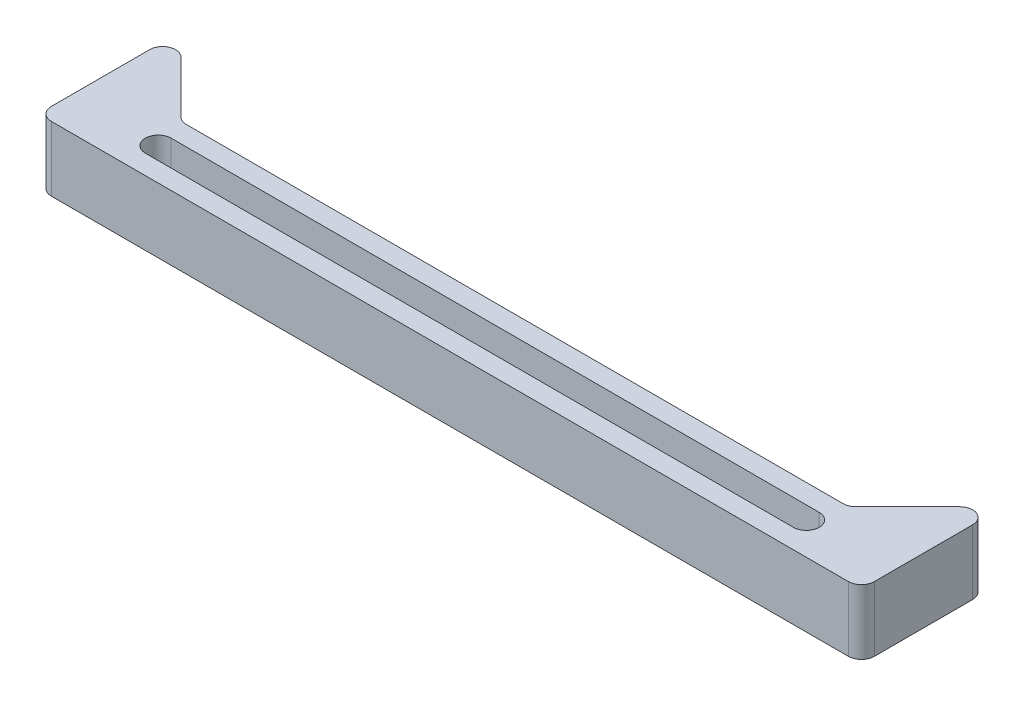
ISO-10303-21;
HEADER;
FILE_DESCRIPTION(('STEP AP214'),'2;1');
FILE_NAME('part.step','',(''),(''),'','','');
FILE_SCHEMA(('AUTOMOTIVE_DESIGN { 1 0 10303 214 1 1 1 1 }'));
ENDSEC;
DATA;
#1=APPLICATION_CONTEXT('core data for automotive mechanical design processes');
#2=APPLICATION_PROTOCOL_DEFINITION('international standard','automotive_design',2000,#1);
#3=PRODUCT_CONTEXT('',#1,'mechanical');
#4=PRODUCT('Part','Part','',(#3));
#5=PRODUCT_RELATED_PRODUCT_CATEGORY('part','',(#4));
#6=PRODUCT_DEFINITION_FORMATION('','',#4);
#7=PRODUCT_DEFINITION_CONTEXT('part definition',#1,'design');
#8=PRODUCT_DEFINITION('design','',#6,#7);
#9=PRODUCT_DEFINITION_SHAPE('','',#8);
#10=(LENGTH_UNIT() NAMED_UNIT(*) SI_UNIT(.MILLI.,.METRE.));
#11=(NAMED_UNIT(*) PLANE_ANGLE_UNIT() SI_UNIT($,.RADIAN.));
#12=(NAMED_UNIT(*) SI_UNIT($,.STERADIAN.) SOLID_ANGLE_UNIT());
#13=UNCERTAINTY_MEASURE_WITH_UNIT(LENGTH_MEASURE(1.E-05),#10,'distance_accuracy_value','');
#14=(GEOMETRIC_REPRESENTATION_CONTEXT(3) GLOBAL_UNCERTAINTY_ASSIGNED_CONTEXT((#13)) GLOBAL_UNIT_ASSIGNED_CONTEXT((#10,
#11,#12)) REPRESENTATION_CONTEXT('',''));
#15=CARTESIAN_POINT('',(0.,0.,0.));
#16=DIRECTION('',(0.,0.,1.));
#17=DIRECTION('',(1.,0.,0.));
#18=AXIS2_PLACEMENT_3D('',#15,#16,#17);
#19=CARTESIAN_POINT('',(-63.5,10.,5.00000000000001));
#20=DIRECTION('',(1.,0.,0.));
#21=DIRECTION('',(0.,0.,-1.));
#22=AXIS2_PLACEMENT_3D('',#19,#20,#21);
#23=PLANE('',#22);
#24=DIRECTION('',(0.,0.,1.));
#25=VECTOR('',#24,1.);
#26=CARTESIAN_POINT('',(-63.5,0.,5.00000000000001));
#27=LINE('',#26,#25);
#28=CARTESIAN_POINT('',(-63.5,0.,-12.1715728752538));
#29=VERTEX_POINT('',#28);
#30=CARTESIAN_POINT('',(-63.5,0.,3.00000000000001));
#31=VERTEX_POINT('',#30);
#32=EDGE_CURVE('E193',#29,#31,#27,.T.);
#33=ORIENTED_EDGE('',*,*,#32,.T.);
#34=DIRECTION('',(0.,-1.,0.));
#35=VECTOR('',#34,1.);
#36=CARTESIAN_POINT('',(-63.5,10.,3.00000000000001));
#37=LINE('',#36,#35);
#38=CARTESIAN_POINT('',(-63.5,10.,3.00000000000001));
#39=VERTEX_POINT('',#38);
#40=EDGE_CURVE('E246',#31,#39,#37,.F.);
#41=ORIENTED_EDGE('',*,*,#40,.T.);
#42=DIRECTION('',(0.,0.,1.));
#43=VECTOR('',#42,1.);
#44=CARTESIAN_POINT('',(-63.5,10.,5.00000000000001));
#45=LINE('',#44,#43);
#46=CARTESIAN_POINT('',(-63.5,10.,-12.1715728752538));
#47=VERTEX_POINT('',#46);
#48=EDGE_CURVE('E194',#47,#39,#45,.T.);
#49=ORIENTED_EDGE('',*,*,#48,.F.);
#50=DIRECTION('',(0.,1.,0.));
#51=VECTOR('',#50,1.);
#52=CARTESIAN_POINT('',(-63.5,0.,-12.1715728752538));
#53=LINE('',#52,#51);
#54=EDGE_CURVE('E244',#47,#29,#53,.F.);
#55=ORIENTED_EDGE('',*,*,#54,.T.);
#56=EDGE_LOOP('',(#33,#41,#49,#55));
#57=FACE_BOUND('',#56,.T.);
#58=ADVANCED_FACE('F33',(#57),#23,.F.);
#59=CARTESIAN_POINT('',(63.5,10.,4.99999999999999));
#60=DIRECTION('',(0.,0.,-1.));
#61=DIRECTION('',(-1.,0.,0.));
#62=AXIS2_PLACEMENT_3D('',#59,#60,#61);
#63=PLANE('',#62);
#64=DIRECTION('',(1.,0.,0.));
#65=VECTOR('',#64,1.);
#66=CARTESIAN_POINT('',(63.5,0.,4.99999999999999));
#67=LINE('',#66,#65);
#68=CARTESIAN_POINT('',(-61.5,0.,5.00000000000001));
#69=VERTEX_POINT('',#68);
#70=CARTESIAN_POINT('',(61.5,0.,4.99999999999999));
#71=VERTEX_POINT('',#70);
#72=EDGE_CURVE('E210',#69,#71,#67,.T.);
#73=ORIENTED_EDGE('',*,*,#72,.T.);
#74=DIRECTION('',(0.,-1.,0.));
#75=VECTOR('',#74,1.);
#76=CARTESIAN_POINT('',(61.5,10.,4.99999999999999));
#77=LINE('',#76,#75);
#78=CARTESIAN_POINT('',(61.5,10.,4.99999999999999));
#79=VERTEX_POINT('',#78);
#80=EDGE_CURVE('E234',#71,#79,#77,.F.);
#81=ORIENTED_EDGE('',*,*,#80,.T.);
#82=DIRECTION('',(1.,0.,0.));
#83=VECTOR('',#82,1.);
#84=CARTESIAN_POINT('',(63.5,10.,4.99999999999999));
#85=LINE('',#84,#83);
#86=CARTESIAN_POINT('',(-61.5,10.,5.00000000000001));
#87=VERTEX_POINT('',#86);
#88=EDGE_CURVE('E197',#87,#79,#85,.T.);
#89=ORIENTED_EDGE('',*,*,#88,.F.);
#90=DIRECTION('',(0.,-1.,0.));
#91=VECTOR('',#90,1.);
#92=CARTESIAN_POINT('',(-61.5,10.,5.00000000000001));
#93=LINE('',#92,#91);
#94=EDGE_CURVE('E231',#87,#69,#93,.T.);
#95=ORIENTED_EDGE('',*,*,#94,.T.);
#96=EDGE_LOOP('',(#73,#81,#89,#95));
#97=FACE_BOUND('',#96,.T.);
#98=ADVANCED_FACE('F307',(#97),#63,.F.);
#99=CARTESIAN_POINT('',(63.5,10.,4.99999999999999));
#100=DIRECTION('',(-1.,0.,0.));
#101=DIRECTION('',(0.,0.,1.));
#102=AXIS2_PLACEMENT_3D('',#99,#100,#101);
#103=PLANE('',#102);
#104=DIRECTION('',(0.,0.,-1.));
#105=VECTOR('',#104,1.);
#106=CARTESIAN_POINT('',(63.5,10.,4.99999999999999));
#107=LINE('',#106,#105);
#108=CARTESIAN_POINT('',(63.5,10.,2.99999999999999));
#109=VERTEX_POINT('',#108);
#110=CARTESIAN_POINT('',(63.5,10.,-12.1715728752538));
#111=VERTEX_POINT('',#110);
#112=EDGE_CURVE('E201',#109,#111,#107,.T.);
#113=ORIENTED_EDGE('',*,*,#112,.F.);
#114=DIRECTION('',(0.,-1.,0.));
#115=VECTOR('',#114,1.);
#116=CARTESIAN_POINT('',(63.5,10.,2.99999999999999));
#117=LINE('',#116,#115);
#118=CARTESIAN_POINT('',(63.5,0.,2.99999999999999));
#119=VERTEX_POINT('',#118);
#120=EDGE_CURVE('E220',#109,#119,#117,.T.);
#121=ORIENTED_EDGE('',*,*,#120,.T.);
#122=DIRECTION('',(0.,0.,-1.));
#123=VECTOR('',#122,1.);
#124=CARTESIAN_POINT('',(63.5,0.,4.99999999999999));
#125=LINE('',#124,#123);
#126=CARTESIAN_POINT('',(63.5,0.,-12.1715728752538));
#127=VERTEX_POINT('',#126);
#128=EDGE_CURVE('E213',#119,#127,#125,.T.);
#129=ORIENTED_EDGE('',*,*,#128,.T.);
#130=DIRECTION('',(0.,1.,0.));
#131=VECTOR('',#130,1.);
#132=CARTESIAN_POINT('',(63.5,10.,-12.1715728752538));
#133=LINE('',#132,#131);
#134=EDGE_CURVE('E207',#127,#111,#133,.T.);
#135=ORIENTED_EDGE('',*,*,#134,.T.);
#136=EDGE_LOOP('',(#113,#121,#129,#135));
#137=FACE_BOUND('',#136,.T.);
#138=ADVANCED_FACE('F299',(#137),#103,.F.);
#139=CARTESIAN_POINT('',(63.5,10.,-5.00000000000001));
#140=DIRECTION('',(0.,0.,1.));
#141=DIRECTION('',(1.,0.,0.));
#142=AXIS2_PLACEMENT_3D('',#139,#140,#141);
#143=PLANE('',#142);
#144=DIRECTION('',(-1.,0.,0.));
#145=VECTOR('',#144,1.);
#146=CARTESIAN_POINT('',(63.5,10.,-5.00000000000001));
#147=LINE('',#146,#145);
#148=CARTESIAN_POINT('',(50.6715728752538,10.,-5.00000000000001));
#149=VERTEX_POINT('',#148);
#150=CARTESIAN_POINT('',(-50.6715728752538,10.,-4.99999999999999));
#151=VERTEX_POINT('',#150);
#152=EDGE_CURVE('E204',#149,#151,#147,.T.);
#153=ORIENTED_EDGE('',*,*,#152,.F.);
#154=DIRECTION('',(0.,1.,0.));
#155=VECTOR('',#154,1.);
#156=CARTESIAN_POINT('',(50.6715728752538,10.,-5.00000000000001));
#157=LINE('',#156,#155);
#158=CARTESIAN_POINT('',(50.6715728752538,0.,-5.00000000000001));
#159=VERTEX_POINT('',#158);
#160=EDGE_CURVE('E256',#149,#159,#157,.F.);
#161=ORIENTED_EDGE('',*,*,#160,.T.);
#162=DIRECTION('',(-1.,0.,0.));
#163=VECTOR('',#162,1.);
#164=CARTESIAN_POINT('',(63.5,0.,-5.00000000000001));
#165=LINE('',#164,#163);
#166=CARTESIAN_POINT('',(-50.6715728752538,0.,-4.99999999999999));
#167=VERTEX_POINT('',#166);
#168=EDGE_CURVE('E198',#159,#167,#165,.T.);
#169=ORIENTED_EDGE('',*,*,#168,.T.);
#170=DIRECTION('',(0.,1.,0.));
#171=VECTOR('',#170,1.);
#172=CARTESIAN_POINT('',(-50.6715728752538,10.,-4.99999999999999));
#173=LINE('',#172,#171);
#174=EDGE_CURVE('E253',#167,#151,#173,.T.);
#175=ORIENTED_EDGE('',*,*,#174,.T.);
#176=EDGE_LOOP('',(#153,#161,#169,#175));
#177=FACE_BOUND('',#176,.T.);
#178=ADVANCED_FACE('F283',(#177),#143,.F.);
#179=CARTESIAN_POINT('',(0.,10.,0.));
#180=DIRECTION('',(0.,1.,0.));
#181=DIRECTION('',(0.,0.,1.));
#182=AXIS2_PLACEMENT_3D('',#179,#180,#181);
#183=PLANE('',#182);
#184=CARTESIAN_POINT('',(-50.,10.,0.));
#185=DIRECTION('',(0.,1.,0.));
#186=DIRECTION('',(0.,0.,1.));
#187=AXIS2_PLACEMENT_3D('',#184,#185,#186);
#188=CIRCLE('',#187,1.99999999999999);
#189=CARTESIAN_POINT('',(-50.,10.,-1.99999999999999));
#190=VERTEX_POINT('',#189);
#191=CARTESIAN_POINT('',(-50.,10.,1.99999999999999));
#192=VERTEX_POINT('',#191);
#193=EDGE_CURVE('E48',#190,#192,#188,.T.);
#194=ORIENTED_EDGE('',*,*,#193,.F.);
#195=DIRECTION('',(-1.,0.,0.));
#196=VECTOR('',#195,1.);
#197=CARTESIAN_POINT('',(-50.,10.,-1.99999999999999));
#198=LINE('',#197,#196);
#199=CARTESIAN_POINT('',(50.,10.,-2.00000000000001));
#200=VERTEX_POINT('',#199);
#201=EDGE_CURVE('E153',#200,#190,#198,.T.);
#202=ORIENTED_EDGE('',*,*,#201,.F.);
#203=CARTESIAN_POINT('',(50.,10.,0.));
#204=DIRECTION('',(0.,1.,0.));
#205=DIRECTION('',(0.,0.,1.));
#206=AXIS2_PLACEMENT_3D('',#203,#204,#205);
#207=CIRCLE('',#206,1.99999999999999);
#208=CARTESIAN_POINT('',(50.,10.,1.99999999999997));
#209=VERTEX_POINT('',#208);
#210=EDGE_CURVE('E173',#209,#200,#207,.T.);
#211=ORIENTED_EDGE('',*,*,#210,.F.);
#212=DIRECTION('',(1.,0.,0.));
#213=VECTOR('',#212,1.);
#214=CARTESIAN_POINT('',(-50.,10.,1.99999999999999));
#215=LINE('',#214,#213);
#216=EDGE_CURVE('E167',#192,#209,#215,.T.);
#217=ORIENTED_EDGE('',*,*,#216,.F.);
#218=EDGE_LOOP('',(#194,#202,#211,#217));
#219=FACE_BOUND('',#218,.T.);
#220=ORIENTED_EDGE('',*,*,#88,.T.);
#221=CARTESIAN_POINT('',(61.5,10.,2.99999999999999));
#222=DIRECTION('',(0.,1.,0.));
#223=DIRECTION('',(0.,0.,1.));
#224=AXIS2_PLACEMENT_3D('',#221,#222,#223);
#225=CIRCLE('',#224,2.);
#226=EDGE_CURVE('E242',#79,#109,#225,.T.);
#227=ORIENTED_EDGE('',*,*,#226,.T.);
#228=ORIENTED_EDGE('',*,*,#112,.T.);
#229=CARTESIAN_POINT('',(61.5,10.,-12.1715728752538));
#230=DIRECTION('',(0.,1.,0.));
#231=DIRECTION('',(0.,0.,1.));
#232=AXIS2_PLACEMENT_3D('',#229,#230,#231);
#233=CIRCLE('',#232,2.);
#234=CARTESIAN_POINT('',(60.0857864376269,10.,-13.5857864376269));
#235=VERTEX_POINT('',#234);
#236=EDGE_CURVE('E238',#111,#235,#233,.T.);
#237=ORIENTED_EDGE('',*,*,#236,.T.);
#238=DIRECTION('',(-0.707106781186548,0.,0.707106781186547));
#239=VECTOR('',#238,1.);
#240=CARTESIAN_POINT('',(63.5,10.,-17.));
#241=LINE('',#240,#239);
#242=CARTESIAN_POINT('',(52.0857864376269,10.,-5.58578643762691));
#243=VERTEX_POINT('',#242);
#244=EDGE_CURVE('E159',#235,#243,#241,.T.);
#245=ORIENTED_EDGE('',*,*,#244,.T.);
#246=CARTESIAN_POINT('',(50.6715728752538,10.,-7.00000000000001));
#247=DIRECTION('',(0.,1.,0.));
#248=DIRECTION('',(0.,0.,1.));
#249=AXIS2_PLACEMENT_3D('',#246,#247,#248);
#250=CIRCLE('',#249,2.);
#251=EDGE_CURVE('E263',#243,#149,#250,.F.);
#252=ORIENTED_EDGE('',*,*,#251,.T.);
#253=ORIENTED_EDGE('',*,*,#152,.T.);
#254=CARTESIAN_POINT('',(-50.6715728752538,10.,-6.99999999999999));
#255=DIRECTION('',(0.,1.,0.));
#256=DIRECTION('',(0.,0.,1.));
#257=AXIS2_PLACEMENT_3D('',#254,#255,#256);
#258=CIRCLE('',#257,2.);
#259=CARTESIAN_POINT('',(-52.0857864376269,10.,-5.58578643762691));
#260=VERTEX_POINT('',#259);
#261=EDGE_CURVE('E41',#151,#260,#258,.F.);
#262=ORIENTED_EDGE('',*,*,#261,.T.);
#263=DIRECTION('',(-0.707106781186548,0.,-0.707106781186547));
#264=VECTOR('',#263,1.);
#265=CARTESIAN_POINT('',(-63.5,10.,-17.));
#266=LINE('',#265,#264);
#267=CARTESIAN_POINT('',(-60.0857864376269,10.,-13.5857864376269));
#268=VERTEX_POINT('',#267);
#269=EDGE_CURVE('E185',#260,#268,#266,.T.);
#270=ORIENTED_EDGE('',*,*,#269,.T.);
#271=CARTESIAN_POINT('',(-61.5,10.,-12.1715728752538));
#272=DIRECTION('',(0.,1.,0.));
#273=DIRECTION('',(0.,0.,1.));
#274=AXIS2_PLACEMENT_3D('',#271,#272,#273);
#275=CIRCLE('',#274,2.);
#276=EDGE_CURVE('E236',#268,#47,#275,.T.);
#277=ORIENTED_EDGE('',*,*,#276,.T.);
#278=ORIENTED_EDGE('',*,*,#48,.T.);
#279=CARTESIAN_POINT('',(-61.5,10.,3.00000000000001));
#280=DIRECTION('',(0.,1.,0.));
#281=DIRECTION('',(0.,0.,1.));
#282=AXIS2_PLACEMENT_3D('',#279,#280,#281);
#283=CIRCLE('',#282,2.);
#284=EDGE_CURVE('E240',#39,#87,#283,.T.);
#285=ORIENTED_EDGE('',*,*,#284,.T.);
#286=EDGE_LOOP('',(#220,#227,#228,#237,#245,#252,#253,#262,#270,#277,#278,#285));
#287=FACE_BOUND('',#286,.T.);
#288=ADVANCED_FACE('F268',(#219,#287),#183,.T.);
#289=CARTESIAN_POINT('',(0.,0.,0.));
#290=DIRECTION('',(0.,1.,0.));
#291=DIRECTION('',(0.,0.,1.));
#292=AXIS2_PLACEMENT_3D('',#289,#290,#291);
#293=PLANE('',#292);
#294=DIRECTION('',(1.,0.,0.));
#295=VECTOR('',#294,1.);
#296=CARTESIAN_POINT('',(-50.,0.,-1.99999999999999));
#297=LINE('',#296,#295);
#298=CARTESIAN_POINT('',(-50.,0.,-1.99999999999999));
#299=VERTEX_POINT('',#298);
#300=CARTESIAN_POINT('',(50.,0.,-2.00000000000001));
#301=VERTEX_POINT('',#300);
#302=EDGE_CURVE('E165',#299,#301,#297,.T.);
#303=ORIENTED_EDGE('',*,*,#302,.F.);
#304=CARTESIAN_POINT('',(-50.,0.,0.));
#305=DIRECTION('',(0.,1.,0.));
#306=DIRECTION('',(0.,0.,1.));
#307=AXIS2_PLACEMENT_3D('',#304,#305,#306);
#308=CIRCLE('',#307,1.99999999999999);
#309=CARTESIAN_POINT('',(-50.,0.,1.99999999999999));
#310=VERTEX_POINT('',#309);
#311=EDGE_CURVE('E147',#310,#299,#308,.F.);
#312=ORIENTED_EDGE('',*,*,#311,.F.);
#313=DIRECTION('',(-1.,0.,0.));
#314=VECTOR('',#313,1.);
#315=CARTESIAN_POINT('',(-50.,0.,1.99999999999999));
#316=LINE('',#315,#314);
#317=CARTESIAN_POINT('',(50.,0.,1.99999999999997));
#318=VERTEX_POINT('',#317);
#319=EDGE_CURVE('E156',#318,#310,#316,.T.);
#320=ORIENTED_EDGE('',*,*,#319,.F.);
#321=CARTESIAN_POINT('',(50.,0.,0.));
#322=DIRECTION('',(0.,1.,0.));
#323=DIRECTION('',(0.,0.,1.));
#324=AXIS2_PLACEMENT_3D('',#321,#322,#323);
#325=CIRCLE('',#324,1.99999999999999);
#326=EDGE_CURVE('E56',#301,#318,#325,.F.);
#327=ORIENTED_EDGE('',*,*,#326,.F.);
#328=EDGE_LOOP('',(#303,#312,#320,#327));
#329=FACE_BOUND('',#328,.T.);
#330=ORIENTED_EDGE('',*,*,#128,.F.);
#331=CARTESIAN_POINT('',(61.5,0.,2.99999999999999));
#332=DIRECTION('',(0.,1.,0.));
#333=DIRECTION('',(0.,0.,1.));
#334=AXIS2_PLACEMENT_3D('',#331,#332,#333);
#335=CIRCLE('',#334,2.);
#336=EDGE_CURVE('E229',#119,#71,#335,.F.);
#337=ORIENTED_EDGE('',*,*,#336,.T.);
#338=ORIENTED_EDGE('',*,*,#72,.F.);
#339=CARTESIAN_POINT('',(-61.5,0.,3.00000000000001));
#340=DIRECTION('',(0.,1.,0.));
#341=DIRECTION('',(0.,0.,1.));
#342=AXIS2_PLACEMENT_3D('',#339,#340,#341);
#343=CIRCLE('',#342,2.);
#344=EDGE_CURVE('E227',#69,#31,#343,.F.);
#345=ORIENTED_EDGE('',*,*,#344,.T.);
#346=ORIENTED_EDGE('',*,*,#32,.F.);
#347=CARTESIAN_POINT('',(-61.5,0.,-12.1715728752538));
#348=DIRECTION('',(0.,1.,0.));
#349=DIRECTION('',(0.,0.,1.));
#350=AXIS2_PLACEMENT_3D('',#347,#348,#349);
#351=CIRCLE('',#350,2.);
#352=CARTESIAN_POINT('',(-60.0857864376269,0.,-13.5857864376269));
#353=VERTEX_POINT('',#352);
#354=EDGE_CURVE('E223',#29,#353,#351,.F.);
#355=ORIENTED_EDGE('',*,*,#354,.T.);
#356=DIRECTION('',(0.707106781186548,0.,0.707106781186547));
#357=VECTOR('',#356,1.);
#358=CARTESIAN_POINT('',(-63.5,0.,-17.));
#359=LINE('',#358,#357);
#360=CARTESIAN_POINT('',(-52.0857864376269,0.,-5.5857864376269));
#361=VERTEX_POINT('',#360);
#362=EDGE_CURVE('E190',#353,#361,#359,.T.);
#363=ORIENTED_EDGE('',*,*,#362,.T.);
#364=CARTESIAN_POINT('',(-50.6715728752538,0.,-6.99999999999999));
#365=DIRECTION('',(0.,1.,0.));
#366=DIRECTION('',(0.,0.,1.));
#367=AXIS2_PLACEMENT_3D('',#364,#365,#366);
#368=CIRCLE('',#367,2.);
#369=EDGE_CURVE('E11',#361,#167,#368,.T.);
#370=ORIENTED_EDGE('',*,*,#369,.T.);
#371=ORIENTED_EDGE('',*,*,#168,.F.);
#372=CARTESIAN_POINT('',(50.6715728752538,0.,-7.00000000000001));
#373=DIRECTION('',(0.,1.,0.));
#374=DIRECTION('',(0.,0.,1.));
#375=AXIS2_PLACEMENT_3D('',#372,#373,#374);
#376=CIRCLE('',#375,2.);
#377=CARTESIAN_POINT('',(52.0857864376269,0.,-5.5857864376269));
#378=VERTEX_POINT('',#377);
#379=EDGE_CURVE('E265',#159,#378,#376,.T.);
#380=ORIENTED_EDGE('',*,*,#379,.T.);
#381=DIRECTION('',(0.707106781186548,0.,-0.707106781186547));
#382=VECTOR('',#381,1.);
#383=CARTESIAN_POINT('',(63.5,0.,-17.));
#384=LINE('',#383,#382);
#385=CARTESIAN_POINT('',(60.0857864376269,0.,-13.5857864376269));
#386=VERTEX_POINT('',#385);
#387=EDGE_CURVE('E182',#378,#386,#384,.T.);
#388=ORIENTED_EDGE('',*,*,#387,.T.);
#389=CARTESIAN_POINT('',(61.5,0.,-12.1715728752538));
#390=DIRECTION('',(0.,1.,0.));
#391=DIRECTION('',(0.,0.,1.));
#392=AXIS2_PLACEMENT_3D('',#389,#390,#391);
#393=CIRCLE('',#392,2.);
#394=EDGE_CURVE('E225',#386,#127,#393,.F.);
#395=ORIENTED_EDGE('',*,*,#394,.T.);
#396=EDGE_LOOP('',(#330,#337,#338,#345,#346,#355,#363,#370,#371,#380,#388,#395));
#397=FACE_BOUND('',#396,.T.);
#398=ADVANCED_FACE('F162',(#329,#397),#293,.F.);
#399=CARTESIAN_POINT('',(-63.5,-16.9705627484771,-17.));
#400=DIRECTION('',(0.707106781186547,0.,-0.707106781186548));
#401=DIRECTION('',(-0.707106781186548,0.,-0.707106781186547));
#402=AXIS2_PLACEMENT_3D('',#399,#400,#401);
#403=PLANE('',#402);
#404=ORIENTED_EDGE('',*,*,#269,.F.);
#405=DIRECTION('',(0.,1.,0.));
#406=VECTOR('',#405,1.);
#407=CARTESIAN_POINT('',(-52.0857864376269,-16.9705627484771,-5.58578643762691));
#408=LINE('',#407,#406);
#409=EDGE_CURVE('E261',#260,#361,#408,.F.);
#410=ORIENTED_EDGE('',*,*,#409,.T.);
#411=ORIENTED_EDGE('',*,*,#362,.F.);
#412=DIRECTION('',(0.,1.,0.));
#413=VECTOR('',#412,1.);
#414=CARTESIAN_POINT('',(-60.0857864376269,10.,-13.5857864376269));
#415=LINE('',#414,#413);
#416=EDGE_CURVE('E258',#353,#268,#415,.T.);
#417=ORIENTED_EDGE('',*,*,#416,.T.);
#418=EDGE_LOOP('',(#404,#410,#411,#417));
#419=FACE_BOUND('',#418,.T.);
#420=ADVANCED_FACE('F274',(#419),#403,.T.);
#421=CARTESIAN_POINT('',(63.5,-16.9705627484771,-17.));
#422=DIRECTION('',(-0.707106781186547,0.,-0.707106781186548));
#423=DIRECTION('',(-0.707106781186548,0.,0.707106781186547));
#424=AXIS2_PLACEMENT_3D('',#421,#422,#423);
#425=PLANE('',#424);
#426=ORIENTED_EDGE('',*,*,#244,.F.);
#427=DIRECTION('',(0.,1.,0.));
#428=VECTOR('',#427,1.);
#429=CARTESIAN_POINT('',(60.0857864376269,0.,-13.5857864376269));
#430=LINE('',#429,#428);
#431=EDGE_CURVE('E251',#235,#386,#430,.F.);
#432=ORIENTED_EDGE('',*,*,#431,.T.);
#433=ORIENTED_EDGE('',*,*,#387,.F.);
#434=DIRECTION('',(0.,1.,0.));
#435=VECTOR('',#434,1.);
#436=CARTESIAN_POINT('',(52.0857864376269,-16.9705627484771,-5.58578643762691));
#437=LINE('',#436,#435);
#438=EDGE_CURVE('E248',#378,#243,#437,.T.);
#439=ORIENTED_EDGE('',*,*,#438,.T.);
#440=EDGE_LOOP('',(#426,#432,#433,#439));
#441=FACE_BOUND('',#440,.T.);
#442=ADVANCED_FACE('F292',(#441),#425,.T.);
#443=CARTESIAN_POINT('',(61.5,10.,2.99999999999999));
#444=DIRECTION('',(0.,-1.,0.));
#445=DIRECTION('',(0.,0.,-1.));
#446=AXIS2_PLACEMENT_3D('',#443,#444,#445);
#447=CYLINDRICAL_SURFACE('',#446,2.);
#448=ORIENTED_EDGE('',*,*,#226,.F.);
#449=ORIENTED_EDGE('',*,*,#80,.F.);
#450=ORIENTED_EDGE('',*,*,#336,.F.);
#451=ORIENTED_EDGE('',*,*,#120,.F.);
#452=EDGE_LOOP('',(#448,#449,#450,#451));
#453=FACE_BOUND('',#452,.T.);
#454=ADVANCED_FACE('F303',(#453),#447,.T.);
#455=CARTESIAN_POINT('',(-61.5,10.,3.00000000000001));
#456=DIRECTION('',(0.,-1.,0.));
#457=DIRECTION('',(0.,0.,-1.));
#458=AXIS2_PLACEMENT_3D('',#455,#456,#457);
#459=CYLINDRICAL_SURFACE('',#458,2.);
#460=ORIENTED_EDGE('',*,*,#284,.F.);
#461=ORIENTED_EDGE('',*,*,#40,.F.);
#462=ORIENTED_EDGE('',*,*,#344,.F.);
#463=ORIENTED_EDGE('',*,*,#94,.F.);
#464=EDGE_LOOP('',(#460,#461,#462,#463));
#465=FACE_BOUND('',#464,.T.);
#466=ADVANCED_FACE('F312',(#465),#459,.T.);
#467=CARTESIAN_POINT('',(61.5,10.,-12.1715728752538));
#468=DIRECTION('',(0.,-1.,0.));
#469=DIRECTION('',(0.,0.,-1.));
#470=AXIS2_PLACEMENT_3D('',#467,#468,#469);
#471=CYLINDRICAL_SURFACE('',#470,2.);
#472=ORIENTED_EDGE('',*,*,#394,.F.);
#473=ORIENTED_EDGE('',*,*,#431,.F.);
#474=ORIENTED_EDGE('',*,*,#236,.F.);
#475=ORIENTED_EDGE('',*,*,#134,.F.);
#476=EDGE_LOOP('',(#472,#473,#474,#475));
#477=FACE_BOUND('',#476,.T.);
#478=ADVANCED_FACE('F295',(#477),#471,.T.);
#479=CARTESIAN_POINT('',(50.6715728752538,-16.9705627484771,-7.00000000000001));
#480=DIRECTION('',(0.,1.,0.));
#481=DIRECTION('',(0.,0.,1.));
#482=AXIS2_PLACEMENT_3D('',#479,#480,#481);
#483=CYLINDRICAL_SURFACE('',#482,2.);
#484=ORIENTED_EDGE('',*,*,#379,.F.);
#485=ORIENTED_EDGE('',*,*,#160,.F.);
#486=ORIENTED_EDGE('',*,*,#251,.F.);
#487=ORIENTED_EDGE('',*,*,#438,.F.);
#488=EDGE_LOOP('',(#484,#485,#486,#487));
#489=FACE_BOUND('',#488,.T.);
#490=ADVANCED_FACE('F286',(#489),#483,.F.);
#491=CARTESIAN_POINT('',(-50.6715728752538,10.,-6.99999999999999));
#492=DIRECTION('',(0.,1.,0.));
#493=DIRECTION('',(0.,0.,1.));
#494=AXIS2_PLACEMENT_3D('',#491,#492,#493);
#495=CYLINDRICAL_SURFACE('',#494,2.);
#496=ORIENTED_EDGE('',*,*,#369,.F.);
#497=ORIENTED_EDGE('',*,*,#409,.F.);
#498=ORIENTED_EDGE('',*,*,#261,.F.);
#499=ORIENTED_EDGE('',*,*,#174,.F.);
#500=EDGE_LOOP('',(#496,#497,#498,#499));
#501=FACE_BOUND('',#500,.T.);
#502=ADVANCED_FACE('F278',(#501),#495,.F.);
#503=CARTESIAN_POINT('',(-61.5,-16.9705627484771,-12.1715728752538));
#504=DIRECTION('',(0.,-1.,0.));
#505=DIRECTION('',(0.,0.,-1.));
#506=AXIS2_PLACEMENT_3D('',#503,#504,#505);
#507=CYLINDRICAL_SURFACE('',#506,2.);
#508=ORIENTED_EDGE('',*,*,#354,.F.);
#509=ORIENTED_EDGE('',*,*,#54,.F.);
#510=ORIENTED_EDGE('',*,*,#276,.F.);
#511=ORIENTED_EDGE('',*,*,#416,.F.);
#512=EDGE_LOOP('',(#508,#509,#510,#511));
#513=FACE_BOUND('',#512,.T.);
#514=ADVANCED_FACE('F35',(#513),#507,.T.);
#515=CARTESIAN_POINT('',(-50.,-0.000999999999999265,0.));
#516=DIRECTION('',(0.,1.,0.));
#517=DIRECTION('',(0.,0.,1.));
#518=AXIS2_PLACEMENT_3D('',#515,#516,#517);
#519=CYLINDRICAL_SURFACE('',#518,1.99999999999999);
#520=ORIENTED_EDGE('',*,*,#311,.T.);
#521=DIRECTION('',(0.,1.,0.));
#522=VECTOR('',#521,1.);
#523=CARTESIAN_POINT('',(-50.,-0.000999999999999265,-1.99999999999999));
#524=LINE('',#523,#522);
#525=EDGE_CURVE('E160',#299,#190,#524,.T.);
#526=ORIENTED_EDGE('',*,*,#525,.T.);
#527=ORIENTED_EDGE('',*,*,#193,.T.);
#528=DIRECTION('',(0.,1.,0.));
#529=VECTOR('',#528,1.);
#530=CARTESIAN_POINT('',(-50.,-0.000999999999999265,1.99999999999999));
#531=LINE('',#530,#529);
#532=EDGE_CURVE('E143',#310,#192,#531,.T.);
#533=ORIENTED_EDGE('',*,*,#532,.F.);
#534=EDGE_LOOP('',(#520,#526,#527,#533));
#535=FACE_BOUND('',#534,.T.);
#536=ADVANCED_FACE('F145',(#535),#519,.F.);
#537=CARTESIAN_POINT('',(-50.,-0.000999999999999265,-1.99999999999999));
#538=DIRECTION('',(0.,0.,-1.));
#539=DIRECTION('',(-1.,0.,0.));
#540=AXIS2_PLACEMENT_3D('',#537,#538,#539);
#541=PLANE('',#540);
#542=ORIENTED_EDGE('',*,*,#302,.T.);
#543=DIRECTION('',(0.,1.,0.));
#544=VECTOR('',#543,1.);
#545=CARTESIAN_POINT('',(50.,-0.000999999999999265,-2.00000000000001));
#546=LINE('',#545,#544);
#547=EDGE_CURVE('E179',#301,#200,#546,.T.);
#548=ORIENTED_EDGE('',*,*,#547,.T.);
#549=ORIENTED_EDGE('',*,*,#201,.T.);
#550=ORIENTED_EDGE('',*,*,#525,.F.);
#551=EDGE_LOOP('',(#542,#548,#549,#550));
#552=FACE_BOUND('',#551,.T.);
#553=ADVANCED_FACE('F325',(#552),#541,.F.);
#554=CARTESIAN_POINT('',(50.,-0.000999999999999265,0.));
#555=DIRECTION('',(0.,1.,0.));
#556=DIRECTION('',(0.,0.,1.));
#557=AXIS2_PLACEMENT_3D('',#554,#555,#556);
#558=CYLINDRICAL_SURFACE('',#557,1.99999999999999);
#559=ORIENTED_EDGE('',*,*,#326,.T.);
#560=DIRECTION('',(0.,1.,0.));
#561=VECTOR('',#560,1.);
#562=CARTESIAN_POINT('',(50.,-0.000999999999999265,1.99999999999997));
#563=LINE('',#562,#561);
#564=EDGE_CURVE('E152',#318,#209,#563,.T.);
#565=ORIENTED_EDGE('',*,*,#564,.T.);
#566=ORIENTED_EDGE('',*,*,#210,.T.);
#567=ORIENTED_EDGE('',*,*,#547,.F.);
#568=EDGE_LOOP('',(#559,#565,#566,#567));
#569=FACE_BOUND('',#568,.T.);
#570=ADVANCED_FACE('F384',(#569),#558,.F.);
#571=CARTESIAN_POINT('',(-50.,-0.000999999999999265,1.99999999999999));
#572=DIRECTION('',(0.,0.,1.));
#573=DIRECTION('',(1.,0.,0.));
#574=AXIS2_PLACEMENT_3D('',#571,#572,#573);
#575=PLANE('',#574);
#576=ORIENTED_EDGE('',*,*,#319,.T.);
#577=ORIENTED_EDGE('',*,*,#532,.T.);
#578=ORIENTED_EDGE('',*,*,#216,.T.);
#579=ORIENTED_EDGE('',*,*,#564,.F.);
#580=EDGE_LOOP('',(#576,#577,#578,#579));
#581=FACE_BOUND('',#580,.T.);
#582=ADVANCED_FACE('F157',(#581),#575,.F.);
#583=CLOSED_SHELL('',(#58,#98,#138,#178,#288,#398,#420,#442,#454,#466,#478,#490,#502,#514,#536,
#553,#570,#582));
#584=MANIFOLD_SOLID_BREP('B2',#583);
#585=ADVANCED_BREP_SHAPE_REPRESENTATION('',(#18,#584),#14);
#586=SHAPE_DEFINITION_REPRESENTATION(#9,#585);
ENDSEC;
END-ISO-10303-21;
